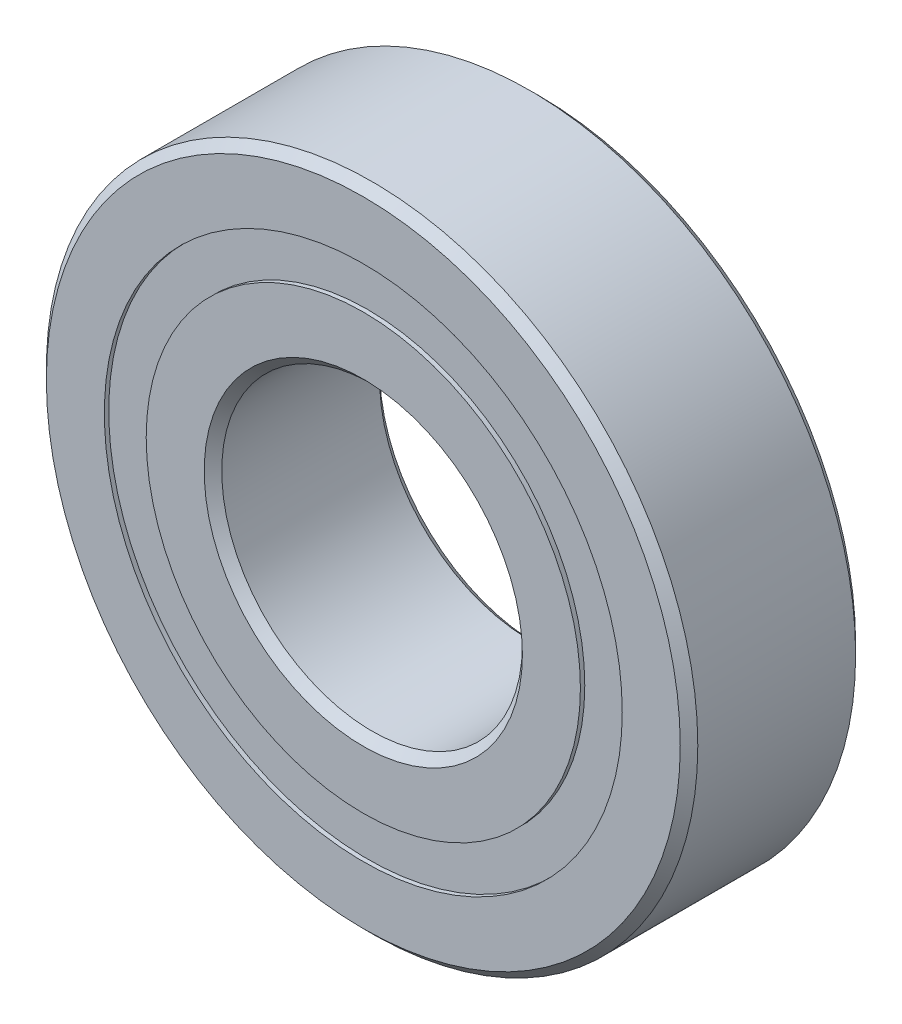
ISO-10303-21;
HEADER;
FILE_DESCRIPTION(('STEP AP214'),'2;1');
FILE_NAME('part.step','',(''),(''),'','','');
FILE_SCHEMA(('AUTOMOTIVE_DESIGN { 1 0 10303 214 1 1 1 1 }'));
ENDSEC;
DATA;
#1=APPLICATION_CONTEXT('core data for automotive mechanical design processes');
#2=APPLICATION_PROTOCOL_DEFINITION('international standard','automotive_design',2000,#1);
#3=PRODUCT_CONTEXT('',#1,'mechanical');
#4=PRODUCT('Part','Part','',(#3));
#5=PRODUCT_RELATED_PRODUCT_CATEGORY('part','',(#4));
#6=PRODUCT_DEFINITION_FORMATION('','',#4);
#7=PRODUCT_DEFINITION_CONTEXT('part definition',#1,'design');
#8=PRODUCT_DEFINITION('design','',#6,#7);
#9=PRODUCT_DEFINITION_SHAPE('','',#8);
#10=(LENGTH_UNIT() NAMED_UNIT(*) SI_UNIT(.MILLI.,.METRE.));
#11=(NAMED_UNIT(*) PLANE_ANGLE_UNIT() SI_UNIT($,.RADIAN.));
#12=(NAMED_UNIT(*) SI_UNIT($,.STERADIAN.) SOLID_ANGLE_UNIT());
#13=UNCERTAINTY_MEASURE_WITH_UNIT(LENGTH_MEASURE(1.E-05),#10,'distance_accuracy_value','');
#14=(GEOMETRIC_REPRESENTATION_CONTEXT(3) GLOBAL_UNCERTAINTY_ASSIGNED_CONTEXT((#13)) GLOBAL_UNIT_ASSIGNED_CONTEXT((#10,
#11,#12)) REPRESENTATION_CONTEXT('',''));
#15=CARTESIAN_POINT('',(0.,0.,0.));
#16=DIRECTION('',(0.,0.,1.));
#17=DIRECTION('',(1.,0.,0.));
#18=AXIS2_PLACEMENT_3D('',#15,#16,#17);
#19=CARTESIAN_POINT('',(0.,16.4070741758242,-5.2784375));
#20=DIRECTION('',(0.,0.,1.));
#21=DIRECTION('',(1.,0.,0.));
#22=AXIS2_PLACEMENT_3D('',#19,#20,#21);
#23=PLANE('',#22);
#24=CARTESIAN_POINT('',(0.,0.,-5.2784375));
#25=DIRECTION('',(0.,0.,1.));
#26=DIRECTION('',(1.,0.,0.));
#27=AXIS2_PLACEMENT_3D('',#24,#25,#26);
#28=CIRCLE('',#27,16.4070741758242);
#29=CARTESIAN_POINT('',(16.4070741758242,0.,-5.2784375));
#30=VERTEX_POINT('',#29);
#31=EDGE_CURVE('E57',#30,#30,#28,.T.);
#32=ORIENTED_EDGE('',*,*,#31,.F.);
#33=EDGE_LOOP('',(#32));
#34=FACE_BOUND('',#33,.T.);
#35=CARTESIAN_POINT('',(0.,0.,-5.2784375));
#36=DIRECTION('',(0.,0.,1.));
#37=DIRECTION('',(1.,0.,0.));
#38=AXIS2_PLACEMENT_3D('',#35,#36,#37);
#39=CIRCLE('',#38,13.7554258241758);
#40=CARTESIAN_POINT('',(13.7554258241758,0.,-5.2784375));
#41=VERTEX_POINT('',#40);
#42=EDGE_CURVE('E11',#41,#41,#39,.T.);
#43=ORIENTED_EDGE('',*,*,#42,.T.);
#44=EDGE_LOOP('',(#43));
#45=FACE_BOUND('',#44,.T.);
#46=ADVANCED_FACE('F43',(#34,#45),#23,.F.);
#47=CARTESIAN_POINT('',(0.,0.,5.55625));
#48=DIRECTION('',(0.,0.,1.));
#49=DIRECTION('',(1.,0.,0.));
#50=AXIS2_PLACEMENT_3D('',#47,#48,#49);
#51=CYLINDRICAL_SURFACE('',#50,13.7554258241758);
#52=ORIENTED_EDGE('',*,*,#42,.F.);
#53=EDGE_LOOP('',(#52));
#54=FACE_BOUND('',#53,.T.);
#55=CARTESIAN_POINT('',(0.,0.,-2.80284955168796));
#56=DIRECTION('',(0.,0.,1.));
#57=DIRECTION('',(1.,0.,0.));
#58=AXIS2_PLACEMENT_3D('',#55,#56,#57);
#59=CIRCLE('',#58,13.7554258241758);
#60=CARTESIAN_POINT('',(13.7554258241758,0.,-2.80284955168796));
#61=VERTEX_POINT('',#60);
#62=EDGE_CURVE('E49',#61,#61,#59,.T.);
#63=ORIENTED_EDGE('',*,*,#62,.T.);
#64=EDGE_LOOP('',(#63));
#65=FACE_BOUND('',#64,.T.);
#66=ADVANCED_FACE('F66',(#54,#65),#51,.F.);
#67=CARTESIAN_POINT('',(0.,16.4070741758242,-2.80284955168796));
#68=DIRECTION('',(0.,0.,-1.));
#69=DIRECTION('',(-1.,0.,0.));
#70=AXIS2_PLACEMENT_3D('',#67,#68,#69);
#71=PLANE('',#70);
#72=ORIENTED_EDGE('',*,*,#62,.F.);
#73=EDGE_LOOP('',(#72));
#74=FACE_BOUND('',#73,.T.);
#75=CARTESIAN_POINT('',(0.,0.,-2.80284955168796));
#76=DIRECTION('',(0.,0.,1.));
#77=DIRECTION('',(1.,0.,0.));
#78=AXIS2_PLACEMENT_3D('',#75,#76,#77);
#79=CIRCLE('',#78,16.4070741758242);
#80=CARTESIAN_POINT('',(16.4070741758242,0.,-2.80284955168796));
#81=VERTEX_POINT('',#80);
#82=EDGE_CURVE('E53',#81,#81,#79,.T.);
#83=ORIENTED_EDGE('',*,*,#82,.T.);
#84=EDGE_LOOP('',(#83));
#85=FACE_BOUND('',#84,.T.);
#86=ADVANCED_FACE('F70',(#74,#85),#71,.F.);
#87=CARTESIAN_POINT('',(0.,0.,5.55625));
#88=DIRECTION('',(0.,0.,1.));
#89=DIRECTION('',(1.,0.,0.));
#90=AXIS2_PLACEMENT_3D('',#87,#88,#89);
#91=CYLINDRICAL_SURFACE('',#90,16.4070741758242);
#92=ORIENTED_EDGE('',*,*,#82,.F.);
#93=EDGE_LOOP('',(#92));
#94=FACE_BOUND('',#93,.T.);
#95=ORIENTED_EDGE('',*,*,#31,.T.);
#96=EDGE_LOOP('',(#95));
#97=FACE_BOUND('',#96,.T.);
#98=ADVANCED_FACE('F63',(#94,#97),#91,.T.);
#99=CLOSED_SHELL('',(#46,#66,#86,#98));
#100=MANIFOLD_SOLID_BREP('B2',#99);
#101=CARTESIAN_POINT('',(0.,16.4070741758242,5.2784375));
#102=DIRECTION('',(0.,0.,-1.));
#103=DIRECTION('',(-1.,0.,0.));
#104=AXIS2_PLACEMENT_3D('',#101,#102,#103);
#105=PLANE('',#104);
#106=CARTESIAN_POINT('',(0.,0.,5.2784375));
#107=DIRECTION('',(0.,0.,1.));
#108=DIRECTION('',(1.,0.,0.));
#109=AXIS2_PLACEMENT_3D('',#106,#107,#108);
#110=CIRCLE('',#109,13.7554258241758);
#111=CARTESIAN_POINT('',(13.7554258241758,0.,5.2784375));
#112=VERTEX_POINT('',#111);
#113=EDGE_CURVE('E42',#112,#112,#110,.T.);
#114=ORIENTED_EDGE('',*,*,#113,.F.);
#115=EDGE_LOOP('',(#114));
#116=FACE_BOUND('',#115,.T.);
#117=CARTESIAN_POINT('',(0.,0.,5.2784375));
#118=DIRECTION('',(0.,0.,1.));
#119=DIRECTION('',(1.,0.,0.));
#120=AXIS2_PLACEMENT_3D('',#117,#118,#119);
#121=CIRCLE('',#120,16.4070741758242);
#122=CARTESIAN_POINT('',(16.4070741758242,0.,5.2784375));
#123=VERTEX_POINT('',#122);
#124=EDGE_CURVE('E124',#123,#123,#121,.T.);
#125=ORIENTED_EDGE('',*,*,#124,.T.);
#126=EDGE_LOOP('',(#125));
#127=FACE_BOUND('',#126,.T.);
#128=ADVANCED_FACE('F110',(#116,#127),#105,.F.);
#129=CARTESIAN_POINT('',(0.,0.,5.55625));
#130=DIRECTION('',(0.,0.,1.));
#131=DIRECTION('',(1.,0.,0.));
#132=AXIS2_PLACEMENT_3D('',#129,#130,#131);
#133=CYLINDRICAL_SURFACE('',#132,13.7554258241758);
#134=CARTESIAN_POINT('',(0.,0.,2.80284955168796));
#135=DIRECTION('',(0.,0.,1.));
#136=DIRECTION('',(1.,0.,0.));
#137=AXIS2_PLACEMENT_3D('',#134,#135,#136);
#138=CIRCLE('',#137,13.7554258241758);
#139=CARTESIAN_POINT('',(13.7554258241758,0.,2.80284955168796));
#140=VERTEX_POINT('',#139);
#141=EDGE_CURVE('E116',#140,#140,#138,.T.);
#142=ORIENTED_EDGE('',*,*,#141,.F.);
#143=EDGE_LOOP('',(#142));
#144=FACE_BOUND('',#143,.T.);
#145=ORIENTED_EDGE('',*,*,#113,.T.);
#146=EDGE_LOOP('',(#145));
#147=FACE_BOUND('',#146,.T.);
#148=ADVANCED_FACE('F139',(#144,#147),#133,.F.);
#149=CARTESIAN_POINT('',(0.,16.4070741758242,2.80284955168796));
#150=DIRECTION('',(0.,0.,1.));
#151=DIRECTION('',(1.,0.,0.));
#152=AXIS2_PLACEMENT_3D('',#149,#150,#151);
#153=PLANE('',#152);
#154=CARTESIAN_POINT('',(0.,0.,2.80284955168796));
#155=DIRECTION('',(0.,0.,1.));
#156=DIRECTION('',(1.,0.,0.));
#157=AXIS2_PLACEMENT_3D('',#154,#155,#156);
#158=CIRCLE('',#157,16.4070741758242);
#159=CARTESIAN_POINT('',(16.4070741758242,0.,2.80284955168796));
#160=VERTEX_POINT('',#159);
#161=EDGE_CURVE('E120',#160,#160,#158,.T.);
#162=ORIENTED_EDGE('',*,*,#161,.F.);
#163=EDGE_LOOP('',(#162));
#164=FACE_BOUND('',#163,.T.);
#165=ORIENTED_EDGE('',*,*,#141,.T.);
#166=EDGE_LOOP('',(#165));
#167=FACE_BOUND('',#166,.T.);
#168=ADVANCED_FACE('F134',(#164,#167),#153,.F.);
#169=CARTESIAN_POINT('',(0.,0.,5.55625));
#170=DIRECTION('',(0.,0.,1.));
#171=DIRECTION('',(1.,0.,0.));
#172=AXIS2_PLACEMENT_3D('',#169,#170,#171);
#173=CYLINDRICAL_SURFACE('',#172,16.4070741758242);
#174=ORIENTED_EDGE('',*,*,#124,.F.);
#175=EDGE_LOOP('',(#174));
#176=FACE_BOUND('',#175,.T.);
#177=ORIENTED_EDGE('',*,*,#161,.T.);
#178=EDGE_LOOP('',(#177));
#179=FACE_BOUND('',#178,.T.);
#180=ADVANCED_FACE('F131',(#176,#179),#173,.T.);
#181=CLOSED_SHELL('',(#128,#148,#168,#180));
#182=MANIFOLD_SOLID_BREP('B6',#181);
#183=CARTESIAN_POINT('',(-7.54062499999983,13.0607456208242,0.));
#184=DIRECTION('',(0.,0.,1.));
#185=DIRECTION('',(-0.499999999999989,0.866025403784445,0.));
#186=AXIS2_PLACEMENT_3D('',#183,#184,#185);
#187=SPHERICAL_SURFACE('',#186,2.80284955168796);
#188=CARTESIAN_POINT('',(-7.54062499999983,13.0607456208242,2.80284955168796));
#189=VERTEX_POINT('',#188);
#190=VERTEX_LOOP('',#189);
#191=FACE_BOUND('',#190,.T.);
#192=ADVANCED_FACE('F177',(#191),#187,.T.);
#193=CLOSED_SHELL('',(#192));
#194=MANIFOLD_SOLID_BREP('B37',#193);
#195=CARTESIAN_POINT('',(-13.060745620824,7.54062500000015,0.));
#196=DIRECTION('',(0.,0.,1.));
#197=DIRECTION('',(-0.866025403784433,0.50000000000001,0.));
#198=AXIS2_PLACEMENT_3D('',#195,#196,#197);
#199=SPHERICAL_SURFACE('',#198,2.80284955168796);
#200=CARTESIAN_POINT('',(-13.060745620824,7.54062500000015,2.80284955168796));
#201=VERTEX_POINT('',#200);
#202=VERTEX_LOOP('',#201);
#203=FACE_BOUND('',#202,.T.);
#204=ADVANCED_FACE('F197',(#203),#199,.T.);
#205=CLOSED_SHELL('',(#204));
#206=MANIFOLD_SOLID_BREP('B106',#205);
#207=CARTESIAN_POINT('',(-15.08125,1.57967708824284E-13,0.));
#208=DIRECTION('',(0.,0.,1.));
#209=DIRECTION('',(-1.,0.,0.));
#210=AXIS2_PLACEMENT_3D('',#207,#208,#209);
#211=SPHERICAL_SURFACE('',#210,2.80284955168796);
#212=CARTESIAN_POINT('',(-15.08125,1.57967708824284E-13,2.80284955168796));
#213=VERTEX_POINT('',#212);
#214=VERTEX_LOOP('',#213);
#215=FACE_BOUND('',#214,.T.);
#216=ADVANCED_FACE('F217',(#215),#211,.T.);
#217=CLOSED_SHELL('',(#216));
#218=MANIFOLD_SOLID_BREP('B173',#217);
#219=CARTESIAN_POINT('',(-13.0607456208241,-7.54062499999988,0.));
#220=DIRECTION('',(0.,0.,1.));
#221=DIRECTION('',(-0.866025403784443,-0.499999999999992,0.));
#222=AXIS2_PLACEMENT_3D('',#219,#220,#221);
#223=SPHERICAL_SURFACE('',#222,2.80284955168796);
#224=CARTESIAN_POINT('',(-13.0607456208241,-7.54062499999988,2.80284955168796));
#225=VERTEX_POINT('',#224);
#226=VERTEX_LOOP('',#225);
#227=FACE_BOUND('',#226,.T.);
#228=ADVANCED_FACE('F237',(#227),#223,.T.);
#229=CLOSED_SHELL('',(#228));
#230=MANIFOLD_SOLID_BREP('B193',#229);
#231=CARTESIAN_POINT('',(-7.54062500000011,-13.060745620824,0.));
#232=DIRECTION('',(0.,0.,1.));
#233=DIRECTION('',(-0.500000000000007,-0.866025403784435,0.));
#234=AXIS2_PLACEMENT_3D('',#231,#232,#233);
#235=SPHERICAL_SURFACE('',#234,2.80284955168796);
#236=CARTESIAN_POINT('',(-7.54062500000011,-13.060745620824,2.80284955168796));
#237=VERTEX_POINT('',#236);
#238=VERTEX_LOOP('',#237);
#239=FACE_BOUND('',#238,.T.);
#240=ADVANCED_FACE('F257',(#239),#235,.T.);
#241=CLOSED_SHELL('',(#240));
#242=MANIFOLD_SOLID_BREP('B213',#241);
#243=CARTESIAN_POINT('',(-1.05311805882856E-13,-15.08125,0.));
#244=DIRECTION('',(0.,0.,1.));
#245=DIRECTION('',(0.,-1.,0.));
#246=AXIS2_PLACEMENT_3D('',#243,#244,#245);
#247=SPHERICAL_SURFACE('',#246,2.80284955168796);
#248=CARTESIAN_POINT('',(-1.05311805882856E-13,-15.08125,2.80284955168796));
#249=VERTEX_POINT('',#248);
#250=VERTEX_LOOP('',#249);
#251=FACE_BOUND('',#250,.T.);
#252=ADVANCED_FACE('F277',(#251),#247,.T.);
#253=CLOSED_SHELL('',(#252));
#254=MANIFOLD_SOLID_BREP('B233',#253);
#255=CARTESIAN_POINT('',(7.54062499999992,-13.0607456208241,0.));
#256=DIRECTION('',(0.,0.,1.));
#257=DIRECTION('',(0.499999999999995,-0.866025403784442,0.));
#258=AXIS2_PLACEMENT_3D('',#255,#256,#257);
#259=SPHERICAL_SURFACE('',#258,2.80284955168796);
#260=CARTESIAN_POINT('',(7.54062499999992,-13.0607456208241,2.80284955168796));
#261=VERTEX_POINT('',#260);
#262=VERTEX_LOOP('',#261);
#263=FACE_BOUND('',#262,.T.);
#264=ADVANCED_FACE('F297',(#263),#259,.T.);
#265=CLOSED_SHELL('',(#264));
#266=MANIFOLD_SOLID_BREP('B253',#265);
#267=CARTESIAN_POINT('',(13.060745620824,-7.54062500000006,0.));
#268=DIRECTION('',(0.,0.,1.));
#269=DIRECTION('',(0.866025403784436,-0.500000000000004,0.));
#270=AXIS2_PLACEMENT_3D('',#267,#268,#269);
#271=SPHERICAL_SURFACE('',#270,2.80284955168796);
#272=CARTESIAN_POINT('',(13.060745620824,-7.54062500000006,2.80284955168796));
#273=VERTEX_POINT('',#272);
#274=VERTEX_LOOP('',#273);
#275=FACE_BOUND('',#274,.T.);
#276=ADVANCED_FACE('F317',(#275),#271,.T.);
#277=CLOSED_SHELL('',(#276));
#278=MANIFOLD_SOLID_BREP('B273',#277);
#279=CARTESIAN_POINT('',(15.08125,0.,0.));
#280=DIRECTION('',(0.,0.,1.));
#281=DIRECTION('',(1.,0.,0.));
#282=AXIS2_PLACEMENT_3D('',#279,#280,#281);
#283=SPHERICAL_SURFACE('',#282,2.80284955168796);
#284=CARTESIAN_POINT('',(15.08125,0.,2.80284955168796));
#285=VERTEX_POINT('',#284);
#286=VERTEX_LOOP('',#285);
#287=FACE_BOUND('',#286,.T.);
#288=ADVANCED_FACE('F337',(#287),#283,.T.);
#289=CLOSED_SHELL('',(#288));
#290=MANIFOLD_SOLID_BREP('B293',#289);
#291=CARTESIAN_POINT('',(13.0607456208241,7.54062499999997,0.));
#292=DIRECTION('',(0.,0.,1.));
#293=DIRECTION('',(0.86602540378444,0.499999999999998,0.));
#294=AXIS2_PLACEMENT_3D('',#291,#292,#293);
#295=SPHERICAL_SURFACE('',#294,2.80284955168796);
#296=CARTESIAN_POINT('',(13.0607456208241,7.54062499999997,2.80284955168796));
#297=VERTEX_POINT('',#296);
#298=VERTEX_LOOP('',#297);
#299=FACE_BOUND('',#298,.T.);
#300=ADVANCED_FACE('F357',(#299),#295,.T.);
#301=CLOSED_SHELL('',(#300));
#302=MANIFOLD_SOLID_BREP('B313',#301);
#303=CARTESIAN_POINT('',(7.54062500000002,13.0607456208241,0.));
#304=DIRECTION('',(0.,0.,1.));
#305=DIRECTION('',(0.500000000000001,0.866025403784438,0.));
#306=AXIS2_PLACEMENT_3D('',#303,#304,#305);
#307=SPHERICAL_SURFACE('',#306,2.80284955168796);
#308=CARTESIAN_POINT('',(7.54062500000002,13.0607456208241,2.80284955168796));
#309=VERTEX_POINT('',#308);
#310=VERTEX_LOOP('',#309);
#311=FACE_BOUND('',#310,.T.);
#312=ADVANCED_FACE('F377',(#311),#307,.T.);
#313=CLOSED_SHELL('',(#312));
#314=MANIFOLD_SOLID_BREP('B333',#313);
#315=CARTESIAN_POINT('',(0.,15.08125,0.));
#316=DIRECTION('',(0.,0.,1.));
#317=DIRECTION('',(0.,1.,0.));
#318=AXIS2_PLACEMENT_3D('',#315,#316,#317);
#319=SPHERICAL_SURFACE('',#318,2.80284955168796);
#320=CARTESIAN_POINT('',(0.,15.08125,2.80284955168796));
#321=VERTEX_POINT('',#320);
#322=VERTEX_LOOP('',#321);
#323=FACE_BOUND('',#322,.T.);
#324=ADVANCED_FACE('F399',(#323),#319,.T.);
#325=CLOSED_SHELL('',(#324));
#326=MANIFOLD_SOLID_BREP('B353',#325);
#327=CARTESIAN_POINT('',(0.,13.7554258241758,5.55625));
#328=DIRECTION('',(0.,0.,-1.));
#329=DIRECTION('',(-1.,0.,0.));
#330=AXIS2_PLACEMENT_3D('',#327,#328,#329);
#331=PLANE('',#330);
#332=CARTESIAN_POINT('',(0.,0.,5.55625));
#333=DIRECTION('',(0.,0.,1.));
#334=DIRECTION('',(1.,0.,0.));
#335=AXIS2_PLACEMENT_3D('',#332,#333,#334);
#336=CIRCLE('',#335,10.080625);
#337=CARTESIAN_POINT('',(10.080625,0.,5.55625));
#338=VERTEX_POINT('',#337);
#339=EDGE_CURVE('E446',#338,#338,#336,.T.);
#340=ORIENTED_EDGE('',*,*,#339,.F.);
#341=EDGE_LOOP('',(#340));
#342=FACE_BOUND('',#341,.T.);
#343=CARTESIAN_POINT('',(0.,0.,5.55625));
#344=DIRECTION('',(0.,0.,1.));
#345=DIRECTION('',(1.,0.,0.));
#346=AXIS2_PLACEMENT_3D('',#343,#344,#345);
#347=CIRCLE('',#346,13.7554258241758);
#348=CARTESIAN_POINT('',(13.7554258241758,0.,5.55625));
#349=VERTEX_POINT('',#348);
#350=EDGE_CURVE('E398',#349,#349,#347,.T.);
#351=ORIENTED_EDGE('',*,*,#350,.T.);
#352=EDGE_LOOP('',(#351));
#353=FACE_BOUND('',#352,.T.);
#354=ADVANCED_FACE('F418',(#342,#353),#331,.F.);
#355=CARTESIAN_POINT('',(0.,0.,5.55625));
#356=DIRECTION('',(0.,0.,1.));
#357=DIRECTION('',(1.,0.,0.));
#358=AXIS2_PLACEMENT_3D('',#355,#356,#357);
#359=CYLINDRICAL_SURFACE('',#358,13.7554258241758);
#360=ORIENTED_EDGE('',*,*,#350,.F.);
#361=EDGE_LOOP('',(#360));
#362=FACE_BOUND('',#361,.T.);
#363=CARTESIAN_POINT('',(0.,0.,2.46944444444444));
#364=DIRECTION('',(0.,0.,1.));
#365=DIRECTION('',(1.,0.,0.));
#366=AXIS2_PLACEMENT_3D('',#363,#364,#365);
#367=CIRCLE('',#366,13.7554258241758);
#368=CARTESIAN_POINT('',(13.7554258241758,0.,2.46944444444444));
#369=VERTEX_POINT('',#368);
#370=EDGE_CURVE('E424',#369,#369,#367,.T.);
#371=ORIENTED_EDGE('',*,*,#370,.T.);
#372=EDGE_LOOP('',(#371));
#373=FACE_BOUND('',#372,.T.);
#374=ADVANCED_FACE('F453',(#362,#373),#359,.T.);
#375=CARTESIAN_POINT('',(0.,0.,0.));
#376=DIRECTION('',(0.,0.,1.));
#377=DIRECTION('',(1.,0.,0.));
#378=AXIS2_PLACEMENT_3D('',#375,#376,#377);
#379=TOROIDAL_SURFACE('',#378,15.08125,2.80284955168795);
#380=ORIENTED_EDGE('',*,*,#370,.F.);
#381=EDGE_LOOP('',(#380));
#382=FACE_BOUND('',#381,.T.);
#383=CARTESIAN_POINT('',(0.,0.,-2.46944444444445));
#384=DIRECTION('',(0.,0.,1.));
#385=DIRECTION('',(1.,0.,0.));
#386=AXIS2_PLACEMENT_3D('',#383,#384,#385);
#387=CIRCLE('',#386,13.7554258241758);
#388=CARTESIAN_POINT('',(13.7554258241758,0.,-2.46944444444445));
#389=VERTEX_POINT('',#388);
#390=EDGE_CURVE('E428',#389,#389,#387,.T.);
#391=ORIENTED_EDGE('',*,*,#390,.T.);
#392=EDGE_LOOP('',(#391));
#393=FACE_BOUND('',#392,.T.);
#394=ADVANCED_FACE('F457',(#382,#393),#379,.F.);
#395=CARTESIAN_POINT('',(0.,0.,5.55625));
#396=DIRECTION('',(0.,0.,1.));
#397=DIRECTION('',(1.,0.,0.));
#398=AXIS2_PLACEMENT_3D('',#395,#396,#397);
#399=CYLINDRICAL_SURFACE('',#398,13.7554258241758);
#400=ORIENTED_EDGE('',*,*,#390,.F.);
#401=EDGE_LOOP('',(#400));
#402=FACE_BOUND('',#401,.T.);
#403=CARTESIAN_POINT('',(0.,0.,-5.55625));
#404=DIRECTION('',(0.,0.,1.));
#405=DIRECTION('',(1.,0.,0.));
#406=AXIS2_PLACEMENT_3D('',#403,#404,#405);
#407=CIRCLE('',#406,13.7554258241758);
#408=CARTESIAN_POINT('',(13.7554258241758,0.,-5.55625));
#409=VERTEX_POINT('',#408);
#410=EDGE_CURVE('E432',#409,#409,#407,.T.);
#411=ORIENTED_EDGE('',*,*,#410,.T.);
#412=EDGE_LOOP('',(#411));
#413=FACE_BOUND('',#412,.T.);
#414=ADVANCED_FACE('F462',(#402,#413),#399,.T.);
#415=CARTESIAN_POINT('',(0.,10.080625,-5.55625));
#416=DIRECTION('',(0.,0.,1.));
#417=DIRECTION('',(1.,0.,0.));
#418=AXIS2_PLACEMENT_3D('',#415,#416,#417);
#419=PLANE('',#418);
#420=ORIENTED_EDGE('',*,*,#410,.F.);
#421=EDGE_LOOP('',(#420));
#422=FACE_BOUND('',#421,.T.);
#423=CARTESIAN_POINT('',(0.,0.,-5.55625));
#424=DIRECTION('',(0.,0.,1.));
#425=DIRECTION('',(1.,0.,0.));
#426=AXIS2_PLACEMENT_3D('',#423,#424,#425);
#427=CIRCLE('',#426,10.080625);
#428=CARTESIAN_POINT('',(10.080625,0.,-5.55625));
#429=VERTEX_POINT('',#428);
#430=EDGE_CURVE('E437',#429,#429,#427,.T.);
#431=ORIENTED_EDGE('',*,*,#430,.T.);
#432=EDGE_LOOP('',(#431));
#433=FACE_BOUND('',#432,.T.);
#434=ADVANCED_FACE('F468',(#422,#433),#419,.F.);
#435=CARTESIAN_POINT('',(0.,0.,-5.000625));
#436=DIRECTION('',(0.,0.,-1.));
#437=DIRECTION('',(-1.,0.,0.));
#438=AXIS2_PLACEMENT_3D('',#435,#436,#437);
#439=CONICAL_SURFACE('',#438,9.525,0.785398163397445);
#440=ORIENTED_EDGE('',*,*,#430,.F.);
#441=EDGE_LOOP('',(#440));
#442=FACE_BOUND('',#441,.T.);
#443=CARTESIAN_POINT('',(0.,0.,-5.000625));
#444=DIRECTION('',(0.,0.,1.));
#445=DIRECTION('',(1.,0.,0.));
#446=AXIS2_PLACEMENT_3D('',#443,#444,#445);
#447=CIRCLE('',#446,9.525);
#448=CARTESIAN_POINT('',(9.525,0.,-5.000625));
#449=VERTEX_POINT('',#448);
#450=EDGE_CURVE('E440',#449,#449,#447,.T.);
#451=ORIENTED_EDGE('',*,*,#450,.T.);
#452=EDGE_LOOP('',(#451));
#453=FACE_BOUND('',#452,.T.);
#454=ADVANCED_FACE('F472',(#442,#453),#439,.F.);
#455=CARTESIAN_POINT('',(0.,0.,5.55625));
#456=DIRECTION('',(0.,0.,1.));
#457=DIRECTION('',(1.,0.,0.));
#458=AXIS2_PLACEMENT_3D('',#455,#456,#457);
#459=CYLINDRICAL_SURFACE('',#458,9.525);
#460=ORIENTED_EDGE('',*,*,#450,.F.);
#461=EDGE_LOOP('',(#460));
#462=FACE_BOUND('',#461,.T.);
#463=CARTESIAN_POINT('',(0.,0.,5.000625));
#464=DIRECTION('',(0.,0.,1.));
#465=DIRECTION('',(1.,0.,0.));
#466=AXIS2_PLACEMENT_3D('',#463,#464,#465);
#467=CIRCLE('',#466,9.525);
#468=CARTESIAN_POINT('',(9.525,0.,5.000625));
#469=VERTEX_POINT('',#468);
#470=EDGE_CURVE('E443',#469,#469,#467,.T.);
#471=ORIENTED_EDGE('',*,*,#470,.T.);
#472=EDGE_LOOP('',(#471));
#473=FACE_BOUND('',#472,.T.);
#474=ADVANCED_FACE('F476',(#462,#473),#459,.F.);
#475=CARTESIAN_POINT('',(0.,0.,5.55625));
#476=DIRECTION('',(0.,0.,1.));
#477=DIRECTION('',(1.,0.,0.));
#478=AXIS2_PLACEMENT_3D('',#475,#476,#477);
#479=CONICAL_SURFACE('',#478,10.080625,0.785398163397452);
#480=ORIENTED_EDGE('',*,*,#470,.F.);
#481=EDGE_LOOP('',(#480));
#482=FACE_BOUND('',#481,.T.);
#483=ORIENTED_EDGE('',*,*,#339,.T.);
#484=EDGE_LOOP('',(#483));
#485=FACE_BOUND('',#484,.T.);
#486=ADVANCED_FACE('F450',(#482,#485),#479,.F.);
#487=CLOSED_SHELL('',(#354,#374,#394,#414,#434,#454,#474,#486));
#488=MANIFOLD_SOLID_BREP('B373',#487);
#489=CARTESIAN_POINT('',(0.,0.,5.000625));
#490=DIRECTION('',(0.,0.,-1.));
#491=DIRECTION('',(-1.,0.,0.));
#492=AXIS2_PLACEMENT_3D('',#489,#490,#491);
#493=CONICAL_SURFACE('',#492,20.6375,0.785398163397446);
#494=CARTESIAN_POINT('',(0.,0.,5.55625));
#495=DIRECTION('',(0.,0.,1.));
#496=DIRECTION('',(1.,0.,0.));
#497=AXIS2_PLACEMENT_3D('',#494,#495,#496);
#498=CIRCLE('',#497,20.081875);
#499=CARTESIAN_POINT('',(20.081875,0.,5.55625));
#500=VERTEX_POINT('',#499);
#501=EDGE_CURVE('E567',#500,#500,#498,.T.);
#502=ORIENTED_EDGE('',*,*,#501,.F.);
#503=EDGE_LOOP('',(#502));
#504=FACE_BOUND('',#503,.T.);
#505=CARTESIAN_POINT('',(0.,0.,5.000625));
#506=DIRECTION('',(0.,0.,1.));
#507=DIRECTION('',(1.,0.,0.));
#508=AXIS2_PLACEMENT_3D('',#505,#506,#507);
#509=CIRCLE('',#508,20.6375);
#510=CARTESIAN_POINT('',(20.6375,0.,5.000625));
#511=VERTEX_POINT('',#510);
#512=EDGE_CURVE('E417',#511,#511,#509,.T.);
#513=ORIENTED_EDGE('',*,*,#512,.T.);
#514=EDGE_LOOP('',(#513));
#515=FACE_BOUND('',#514,.T.);
#516=ADVANCED_FACE('F539',(#504,#515),#493,.T.);
#517=CARTESIAN_POINT('',(0.,0.,5.55625));
#518=DIRECTION('',(0.,0.,1.));
#519=DIRECTION('',(1.,0.,0.));
#520=AXIS2_PLACEMENT_3D('',#517,#518,#519);
#521=CYLINDRICAL_SURFACE('',#520,20.6375);
#522=ORIENTED_EDGE('',*,*,#512,.F.);
#523=EDGE_LOOP('',(#522));
#524=FACE_BOUND('',#523,.T.);
#525=CARTESIAN_POINT('',(0.,0.,-5.000625));
#526=DIRECTION('',(0.,0.,1.));
#527=DIRECTION('',(1.,0.,0.));
#528=AXIS2_PLACEMENT_3D('',#525,#526,#527);
#529=CIRCLE('',#528,20.6375);
#530=CARTESIAN_POINT('',(20.6375,0.,-5.000625));
#531=VERTEX_POINT('',#530);
#532=EDGE_CURVE('E545',#531,#531,#529,.T.);
#533=ORIENTED_EDGE('',*,*,#532,.T.);
#534=EDGE_LOOP('',(#533));
#535=FACE_BOUND('',#534,.T.);
#536=ADVANCED_FACE('F574',(#524,#535),#521,.T.);
#537=CARTESIAN_POINT('',(0.,0.,-5.55625));
#538=DIRECTION('',(0.,0.,1.));
#539=DIRECTION('',(1.,0.,0.));
#540=AXIS2_PLACEMENT_3D('',#537,#538,#539);
#541=CONICAL_SURFACE('',#540,20.081875,0.785398163397445);
#542=ORIENTED_EDGE('',*,*,#532,.F.);
#543=EDGE_LOOP('',(#542));
#544=FACE_BOUND('',#543,.T.);
#545=CARTESIAN_POINT('',(0.,0.,-5.55625));
#546=DIRECTION('',(0.,0.,1.));
#547=DIRECTION('',(1.,0.,0.));
#548=AXIS2_PLACEMENT_3D('',#545,#546,#547);
#549=CIRCLE('',#548,20.081875);
#550=CARTESIAN_POINT('',(20.081875,0.,-5.55625));
#551=VERTEX_POINT('',#550);
#552=EDGE_CURVE('E549',#551,#551,#549,.T.);
#553=ORIENTED_EDGE('',*,*,#552,.T.);
#554=EDGE_LOOP('',(#553));
#555=FACE_BOUND('',#554,.T.);
#556=ADVANCED_FACE('F578',(#544,#555),#541,.T.);
#557=CARTESIAN_POINT('',(0.,20.081875,-5.55625));
#558=DIRECTION('',(0.,0.,1.));
#559=DIRECTION('',(1.,0.,0.));
#560=AXIS2_PLACEMENT_3D('',#557,#558,#559);
#561=PLANE('',#560);
#562=ORIENTED_EDGE('',*,*,#552,.F.);
#563=EDGE_LOOP('',(#562));
#564=FACE_BOUND('',#563,.T.);
#565=CARTESIAN_POINT('',(0.,0.,-5.55625));
#566=DIRECTION('',(0.,0.,1.));
#567=DIRECTION('',(1.,0.,0.));
#568=AXIS2_PLACEMENT_3D('',#565,#566,#567);
#569=CIRCLE('',#568,16.4070741758242);
#570=CARTESIAN_POINT('',(16.4070741758242,0.,-5.55625));
#571=VERTEX_POINT('',#570);
#572=EDGE_CURVE('E553',#571,#571,#569,.T.);
#573=ORIENTED_EDGE('',*,*,#572,.T.);
#574=EDGE_LOOP('',(#573));
#575=FACE_BOUND('',#574,.T.);
#576=ADVANCED_FACE('F583',(#564,#575),#561,.F.);
#577=CARTESIAN_POINT('',(0.,0.,5.55625));
#578=DIRECTION('',(0.,0.,1.));
#579=DIRECTION('',(1.,0.,0.));
#580=AXIS2_PLACEMENT_3D('',#577,#578,#579);
#581=CYLINDRICAL_SURFACE('',#580,16.4070741758242);
#582=ORIENTED_EDGE('',*,*,#572,.F.);
#583=EDGE_LOOP('',(#582));
#584=FACE_BOUND('',#583,.T.);
#585=CARTESIAN_POINT('',(0.,0.,-2.46944444444444));
#586=DIRECTION('',(0.,0.,1.));
#587=DIRECTION('',(1.,0.,0.));
#588=AXIS2_PLACEMENT_3D('',#585,#586,#587);
#589=CIRCLE('',#588,16.4070741758242);
#590=CARTESIAN_POINT('',(16.4070741758242,0.,-2.46944444444444));
#591=VERTEX_POINT('',#590);
#592=EDGE_CURVE('E558',#591,#591,#589,.T.);
#593=ORIENTED_EDGE('',*,*,#592,.T.);
#594=EDGE_LOOP('',(#593));
#595=FACE_BOUND('',#594,.T.);
#596=ADVANCED_FACE('F589',(#584,#595),#581,.F.);
#597=CARTESIAN_POINT('',(0.,0.,0.));
#598=DIRECTION('',(0.,0.,1.));
#599=DIRECTION('',(1.,0.,0.));
#600=AXIS2_PLACEMENT_3D('',#597,#598,#599);
#601=TOROIDAL_SURFACE('',#600,15.08125,2.80284955168796);
#602=ORIENTED_EDGE('',*,*,#592,.F.);
#603=EDGE_LOOP('',(#602));
#604=FACE_BOUND('',#603,.T.);
#605=CARTESIAN_POINT('',(0.,0.,2.46944444444444));
#606=DIRECTION('',(0.,0.,1.));
#607=DIRECTION('',(1.,0.,0.));
#608=AXIS2_PLACEMENT_3D('',#605,#606,#607);
#609=CIRCLE('',#608,16.4070741758242);
#610=CARTESIAN_POINT('',(16.4070741758242,0.,2.46944444444444));
#611=VERTEX_POINT('',#610);
#612=EDGE_CURVE('E561',#611,#611,#609,.T.);
#613=ORIENTED_EDGE('',*,*,#612,.T.);
#614=EDGE_LOOP('',(#613));
#615=FACE_BOUND('',#614,.T.);
#616=ADVANCED_FACE('F593',(#604,#615),#601,.F.);
#617=CARTESIAN_POINT('',(0.,0.,5.55625));
#618=DIRECTION('',(0.,0.,1.));
#619=DIRECTION('',(1.,0.,0.));
#620=AXIS2_PLACEMENT_3D('',#617,#618,#619);
#621=CYLINDRICAL_SURFACE('',#620,16.4070741758242);
#622=ORIENTED_EDGE('',*,*,#612,.F.);
#623=EDGE_LOOP('',(#622));
#624=FACE_BOUND('',#623,.T.);
#625=CARTESIAN_POINT('',(0.,0.,5.55625));
#626=DIRECTION('',(0.,0.,1.));
#627=DIRECTION('',(1.,0.,0.));
#628=AXIS2_PLACEMENT_3D('',#625,#626,#627);
#629=CIRCLE('',#628,16.4070741758242);
#630=CARTESIAN_POINT('',(16.4070741758242,0.,5.55625));
#631=VERTEX_POINT('',#630);
#632=EDGE_CURVE('E564',#631,#631,#629,.T.);
#633=ORIENTED_EDGE('',*,*,#632,.T.);
#634=EDGE_LOOP('',(#633));
#635=FACE_BOUND('',#634,.T.);
#636=ADVANCED_FACE('F597',(#624,#635),#621,.F.);
#637=CARTESIAN_POINT('',(0.,20.081875,5.55625));
#638=DIRECTION('',(0.,0.,-1.));
#639=DIRECTION('',(-1.,0.,0.));
#640=AXIS2_PLACEMENT_3D('',#637,#638,#639);
#641=PLANE('',#640);
#642=ORIENTED_EDGE('',*,*,#632,.F.);
#643=EDGE_LOOP('',(#642));
#644=FACE_BOUND('',#643,.T.);
#645=ORIENTED_EDGE('',*,*,#501,.T.);
#646=EDGE_LOOP('',(#645));
#647=FACE_BOUND('',#646,.T.);
#648=ADVANCED_FACE('F571',(#644,#647),#641,.F.);
#649=CLOSED_SHELL('',(#516,#536,#556,#576,#596,#616,#636,#648));
#650=MANIFOLD_SOLID_BREP('B393',#649);
#651=ADVANCED_BREP_SHAPE_REPRESENTATION('',(#18,#100,#182,#194,#206,#218,#230,#242,#254,#266,
#278,#290,#302,#314,#326,#488,#650),#14);
#652=SHAPE_DEFINITION_REPRESENTATION(#9,#651);
ENDSEC;
END-ISO-10303-21;
